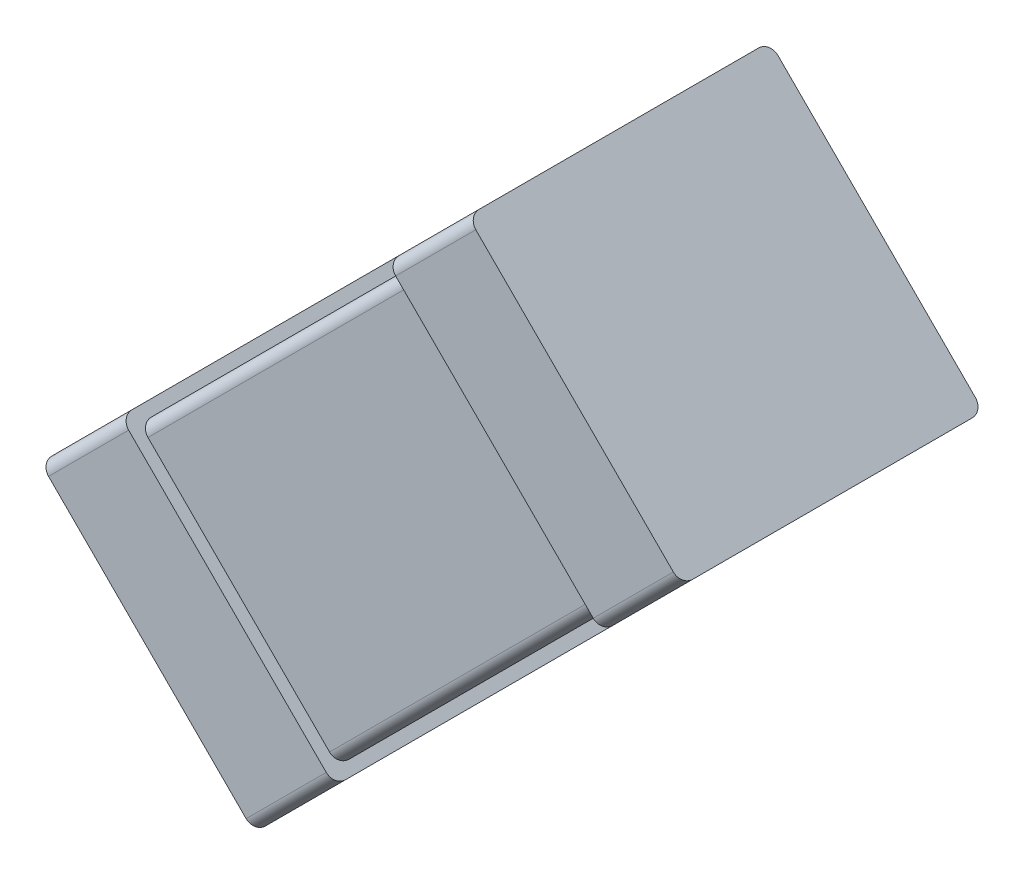
ISO-10303-21;
HEADER;
FILE_DESCRIPTION(('STEP AP214'),'2;1');
FILE_NAME('part.step','',(''),(''),'','','');
FILE_SCHEMA(('AUTOMOTIVE_DESIGN { 1 0 10303 214 1 1 1 1 }'));
ENDSEC;
DATA;
#1=APPLICATION_CONTEXT('core data for automotive mechanical design processes');
#2=APPLICATION_PROTOCOL_DEFINITION('international standard','automotive_design',2000,#1);
#3=PRODUCT_CONTEXT('',#1,'mechanical');
#4=PRODUCT('Part','Part','',(#3));
#5=PRODUCT_RELATED_PRODUCT_CATEGORY('part','',(#4));
#6=PRODUCT_DEFINITION_FORMATION('','',#4);
#7=PRODUCT_DEFINITION_CONTEXT('part definition',#1,'design');
#8=PRODUCT_DEFINITION('design','',#6,#7);
#9=PRODUCT_DEFINITION_SHAPE('','',#8);
#10=(LENGTH_UNIT() NAMED_UNIT(*) SI_UNIT(.MILLI.,.METRE.));
#11=(NAMED_UNIT(*) PLANE_ANGLE_UNIT() SI_UNIT($,.RADIAN.));
#12=(NAMED_UNIT(*) SI_UNIT($,.STERADIAN.) SOLID_ANGLE_UNIT());
#13=UNCERTAINTY_MEASURE_WITH_UNIT(LENGTH_MEASURE(1.E-05),#10,'distance_accuracy_value','');
#14=(GEOMETRIC_REPRESENTATION_CONTEXT(3) GLOBAL_UNCERTAINTY_ASSIGNED_CONTEXT((#13)) GLOBAL_UNIT_ASSIGNED_CONTEXT((#10,
#11,#12)) REPRESENTATION_CONTEXT('',''));
#15=CARTESIAN_POINT('',(0.,0.,0.));
#16=DIRECTION('',(0.,0.,1.));
#17=DIRECTION('',(1.,0.,0.));
#18=AXIS2_PLACEMENT_3D('',#15,#16,#17);
#19=CARTESIAN_POINT('',(157.545272417362,106.640886004825,112.211582908599));
#20=DIRECTION('',(0.707106781186547,0.707106781186548,0.));
#21=DIRECTION('',(0.,0.,-1.));
#22=AXIS2_PLACEMENT_3D('',#19,#20,#21);
#23=PLANE('',#22);
#24=DIRECTION('',(0.,0.,1.));
#25=VECTOR('',#24,1.);
#26=CARTESIAN_POINT('',(157.545272417362,106.640886004825,112.211582908599));
#27=LINE('',#26,#25);
#28=CARTESIAN_POINT('',(157.545272417362,106.640886004825,112.241582908599));
#29=VERTEX_POINT('',#28);
#30=CARTESIAN_POINT('',(157.545272417362,106.640886004825,112.981582908599));
#31=VERTEX_POINT('',#30);
#32=EDGE_CURVE('E67',#29,#31,#27,.T.);
#33=ORIENTED_EDGE('',*,*,#32,.F.);
#34=CARTESIAN_POINT('',(157.524059213927,106.66209920826,112.241582908599));
#35=DIRECTION('',(0.707106781186547,0.707106781186548,0.));
#36=DIRECTION('',(0.,0.,1.));
#37=AXIS2_PLACEMENT_3D('',#34,#35,#36);
#38=CIRCLE('',#37,0.0300000000000023);
#39=CARTESIAN_POINT('',(157.524059213927,106.66209920826,112.211582908599));
#40=VERTEX_POINT('',#39);
#41=EDGE_CURVE('E11',#29,#40,#38,.T.);
#42=ORIENTED_EDGE('',*,*,#41,.T.);
#43=DIRECTION('',(-0.707106781186548,0.707106781186547,0.));
#44=VECTOR('',#43,1.);
#45=CARTESIAN_POINT('',(157.545272417362,106.640886004825,112.211582908599));
#46=LINE('',#45,#44);
#47=CARTESIAN_POINT('',(157.000800195848,107.185358226338,112.211582908599));
#48=VERTEX_POINT('',#47);
#49=EDGE_CURVE('E55',#40,#48,#46,.T.);
#50=ORIENTED_EDGE('',*,*,#49,.T.);
#51=CARTESIAN_POINT('',(157.000800195848,107.185358226338,112.241582908599));
#52=DIRECTION('',(-0.707106781186547,-0.707106781186548,0.));
#53=DIRECTION('',(0.,0.,1.));
#54=AXIS2_PLACEMENT_3D('',#51,#52,#53);
#55=CIRCLE('',#54,0.0300000000000023);
#56=CARTESIAN_POINT('',(156.979586992412,107.206571429774,112.241582908599));
#57=VERTEX_POINT('',#56);
#58=EDGE_CURVE('E309',#57,#48,#55,.T.);
#59=ORIENTED_EDGE('',*,*,#58,.F.);
#60=DIRECTION('',(0.,0.,1.));
#61=VECTOR('',#60,1.);
#62=CARTESIAN_POINT('',(156.979586992412,107.206571429774,112.211582908599));
#63=LINE('',#62,#61);
#64=CARTESIAN_POINT('',(156.979586992412,107.206571429774,112.981582908599));
#65=VERTEX_POINT('',#64);
#66=EDGE_CURVE('E323',#57,#65,#63,.T.);
#67=ORIENTED_EDGE('',*,*,#66,.T.);
#68=CARTESIAN_POINT('',(157.000800195848,107.185358226338,112.981582908599));
#69=DIRECTION('',(0.707106781186547,0.707106781186548,0.));
#70=DIRECTION('',(0.,0.,1.));
#71=AXIS2_PLACEMENT_3D('',#68,#69,#70);
#72=CIRCLE('',#71,0.0300000000000023);
#73=CARTESIAN_POINT('',(157.000800195848,107.185358226338,113.011582908599));
#74=VERTEX_POINT('',#73);
#75=EDGE_CURVE('E327',#65,#74,#72,.T.);
#76=ORIENTED_EDGE('',*,*,#75,.T.);
#77=DIRECTION('',(-0.707106781186548,0.707106781186547,0.));
#78=VECTOR('',#77,1.);
#79=CARTESIAN_POINT('',(157.545272417362,106.640886004825,113.011582908599));
#80=LINE('',#79,#78);
#81=CARTESIAN_POINT('',(157.524059213927,106.66209920826,113.011582908599));
#82=VERTEX_POINT('',#81);
#83=EDGE_CURVE('E363',#82,#74,#80,.T.);
#84=ORIENTED_EDGE('',*,*,#83,.F.);
#85=CARTESIAN_POINT('',(157.524059213927,106.66209920826,112.981582908599));
#86=DIRECTION('',(-0.707106781186547,-0.707106781186548,0.));
#87=DIRECTION('',(0.,0.,1.));
#88=AXIS2_PLACEMENT_3D('',#85,#86,#87);
#89=CIRCLE('',#88,0.0300000000000023);
#90=EDGE_CURVE('E343',#31,#82,#89,.T.);
#91=ORIENTED_EDGE('',*,*,#90,.F.);
#92=EDGE_LOOP('',(#33,#42,#50,#59,#67,#76,#84,#91));
#93=FACE_BOUND('',#92,.T.);
#94=ADVANCED_FACE('F44',(#93),#23,.T.);
#95=CARTESIAN_POINT('',(156.767454958057,106.994439395418,112.211582908599));
#96=DIRECTION('',(-0.707106781186548,0.707106781186547,0.));
#97=DIRECTION('',(0.,0.,1.));
#98=AXIS2_PLACEMENT_3D('',#95,#96,#97);
#99=PLANE('',#98);
#100=ORIENTED_EDGE('',*,*,#66,.F.);
#101=DIRECTION('',(0.707106781186547,0.707106781186548,0.));
#102=VECTOR('',#101,1.);
#103=CARTESIAN_POINT('',(156.767454958057,106.994439395418,112.241582908599));
#104=LINE('',#103,#102);
#105=CARTESIAN_POINT('',(156.767454958057,106.994439395418,112.241582908599));
#106=VERTEX_POINT('',#105);
#107=EDGE_CURVE('E305',#106,#57,#104,.T.);
#108=ORIENTED_EDGE('',*,*,#107,.F.);
#109=DIRECTION('',(0.,0.,1.));
#110=VECTOR('',#109,1.);
#111=CARTESIAN_POINT('',(156.767454958057,106.994439395418,112.211582908599));
#112=LINE('',#111,#110);
#113=CARTESIAN_POINT('',(156.767454958057,106.994439395418,112.981582908599));
#114=VERTEX_POINT('',#113);
#115=EDGE_CURVE('E351',#106,#114,#112,.T.);
#116=ORIENTED_EDGE('',*,*,#115,.T.);
#117=DIRECTION('',(0.707106781186547,0.707106781186548,0.));
#118=VECTOR('',#117,1.);
#119=CARTESIAN_POINT('',(156.767454958057,106.994439395418,112.981582908599));
#120=LINE('',#119,#118);
#121=EDGE_CURVE('E393',#114,#65,#120,.T.);
#122=ORIENTED_EDGE('',*,*,#121,.T.);
#123=EDGE_LOOP('',(#100,#108,#116,#122));
#124=FACE_BOUND('',#123,.T.);
#125=ADVANCED_FACE('F602',(#124),#99,.T.);
#126=CARTESIAN_POINT('',(156.788668161492,106.973226191982,112.981582908599));
#127=DIRECTION('',(0.707106781186548,0.707106781186548,0.));
#128=DIRECTION('',(-0.707106781186548,0.707106781186548,0.));
#129=AXIS2_PLACEMENT_3D('',#126,#127,#128);
#130=CYLINDRICAL_SURFACE('',#129,0.0299999999999963);
#131=CARTESIAN_POINT('',(156.788668161492,106.973226191982,112.981582908599));
#132=DIRECTION('',(0.707106781186547,0.707106781186548,0.));
#133=DIRECTION('',(0.,0.,1.));
#134=AXIS2_PLACEMENT_3D('',#131,#132,#133);
#135=CIRCLE('',#134,0.0300000000000023);
#136=CARTESIAN_POINT('',(156.788668161492,106.973226191982,113.011582908599));
#137=VERTEX_POINT('',#136);
#138=EDGE_CURVE('E319',#114,#137,#135,.T.);
#139=ORIENTED_EDGE('',*,*,#138,.T.);
#140=DIRECTION('',(0.707106781186547,0.707106781186548,0.));
#141=VECTOR('',#140,1.);
#142=CARTESIAN_POINT('',(156.788668161492,106.973226191982,113.011582908599));
#143=LINE('',#142,#141);
#144=EDGE_CURVE('E308',#137,#74,#143,.T.);
#145=ORIENTED_EDGE('',*,*,#144,.T.);
#146=ORIENTED_EDGE('',*,*,#75,.F.);
#147=ORIENTED_EDGE('',*,*,#121,.F.);
#148=EDGE_LOOP('',(#139,#145,#146,#147));
#149=FACE_BOUND('',#148,.T.);
#150=ADVANCED_FACE('F512',(#149),#130,.T.);
#151=CARTESIAN_POINT('',(156.788668161492,106.973226191982,112.241582908599));
#152=DIRECTION('',(0.707106781186548,0.707106781186548,0.));
#153=DIRECTION('',(-0.707106781186548,0.707106781186548,0.));
#154=AXIS2_PLACEMENT_3D('',#151,#152,#153);
#155=CYLINDRICAL_SURFACE('',#154,0.0299999999999963);
#156=ORIENTED_EDGE('',*,*,#107,.T.);
#157=ORIENTED_EDGE('',*,*,#58,.T.);
#158=DIRECTION('',(0.707106781186547,0.707106781186548,0.));
#159=VECTOR('',#158,1.);
#160=CARTESIAN_POINT('',(156.788668161492,106.973226191982,112.211582908599));
#161=LINE('',#160,#159);
#162=CARTESIAN_POINT('',(156.788668161492,106.973226191982,112.211582908599));
#163=VERTEX_POINT('',#162);
#164=EDGE_CURVE('E359',#163,#48,#161,.T.);
#165=ORIENTED_EDGE('',*,*,#164,.F.);
#166=CARTESIAN_POINT('',(156.788668161492,106.973226191982,112.241582908599));
#167=DIRECTION('',(-0.707106781186547,-0.707106781186548,0.));
#168=DIRECTION('',(0.,0.,1.));
#169=AXIS2_PLACEMENT_3D('',#166,#167,#168);
#170=CIRCLE('',#169,0.0300000000000023);
#171=EDGE_CURVE('E397',#106,#163,#170,.T.);
#172=ORIENTED_EDGE('',*,*,#171,.F.);
#173=EDGE_LOOP('',(#156,#157,#165,#172));
#174=FACE_BOUND('',#173,.T.);
#175=ADVANCED_FACE('F600',(#174),#155,.T.);
#176=CARTESIAN_POINT('',(157.333140383006,106.428753970469,113.011582908599));
#177=DIRECTION('',(0.,0.,1.));
#178=DIRECTION('',(1.,0.,0.));
#179=AXIS2_PLACEMENT_3D('',#176,#177,#178);
#180=PLANE('',#179);
#181=DIRECTION('',(-0.707106781186548,0.707106781186547,0.));
#182=VECTOR('',#181,1.);
#183=CARTESIAN_POINT('',(157.333140383006,106.428753970469,113.011582908599));
#184=LINE('',#183,#182);
#185=CARTESIAN_POINT('',(157.31192717957,106.449967173904,113.011582908599));
#186=VERTEX_POINT('',#185);
#187=EDGE_CURVE('E407',#186,#137,#184,.T.);
#188=ORIENTED_EDGE('',*,*,#187,.F.);
#189=DIRECTION('',(0.707106781186547,0.707106781186548,0.));
#190=VECTOR('',#189,1.);
#191=CARTESIAN_POINT('',(157.31192717957,106.449967173904,113.011582908599));
#192=LINE('',#191,#190);
#193=EDGE_CURVE('E322',#186,#82,#192,.T.);
#194=ORIENTED_EDGE('',*,*,#193,.T.);
#195=ORIENTED_EDGE('',*,*,#83,.T.);
#196=ORIENTED_EDGE('',*,*,#144,.F.);
#197=EDGE_LOOP('',(#188,#194,#195,#196));
#198=FACE_BOUND('',#197,.T.);
#199=ADVANCED_FACE('F46',(#198),#180,.T.);
#200=CARTESIAN_POINT('',(157.333140383006,106.428753970469,112.211582908599));
#201=DIRECTION('',(0.,0.,1.));
#202=DIRECTION('',(1.,0.,0.));
#203=AXIS2_PLACEMENT_3D('',#200,#201,#202);
#204=PLANE('',#203);
#205=ORIENTED_EDGE('',*,*,#164,.T.);
#206=ORIENTED_EDGE('',*,*,#49,.F.);
#207=DIRECTION('',(0.707106781186547,0.707106781186548,0.));
#208=VECTOR('',#207,1.);
#209=CARTESIAN_POINT('',(157.31192717957,106.449967173904,112.211582908599));
#210=LINE('',#209,#208);
#211=CARTESIAN_POINT('',(157.31192717957,106.449967173904,112.211582908599));
#212=VERTEX_POINT('',#211);
#213=EDGE_CURVE('E48',#212,#40,#210,.T.);
#214=ORIENTED_EDGE('',*,*,#213,.F.);
#215=DIRECTION('',(-0.707106781186548,0.707106781186547,0.));
#216=VECTOR('',#215,1.);
#217=CARTESIAN_POINT('',(157.333140383006,106.428753970469,112.211582908599));
#218=LINE('',#217,#216);
#219=EDGE_CURVE('E364',#212,#163,#218,.T.);
#220=ORIENTED_EDGE('',*,*,#219,.T.);
#221=EDGE_LOOP('',(#205,#206,#214,#220));
#222=FACE_BOUND('',#221,.T.);
#223=ADVANCED_FACE('F596',(#222),#204,.F.);
#224=CARTESIAN_POINT('',(157.31192717957,106.449967173904,112.981582908599));
#225=DIRECTION('',(0.707106781186548,0.707106781186548,0.));
#226=DIRECTION('',(0.707106781186548,-0.707106781186548,0.));
#227=AXIS2_PLACEMENT_3D('',#224,#225,#226);
#228=CYLINDRICAL_SURFACE('',#227,0.0299999999999963);
#229=DIRECTION('',(0.707106781186547,0.707106781186548,0.));
#230=VECTOR('',#229,1.);
#231=CARTESIAN_POINT('',(157.333140383006,106.428753970469,112.981582908599));
#232=LINE('',#231,#230);
#233=CARTESIAN_POINT('',(157.333140383006,106.428753970469,112.981582908599));
#234=VERTEX_POINT('',#233);
#235=EDGE_CURVE('E346',#234,#31,#232,.T.);
#236=ORIENTED_EDGE('',*,*,#235,.T.);
#237=ORIENTED_EDGE('',*,*,#90,.T.);
#238=ORIENTED_EDGE('',*,*,#193,.F.);
#239=CARTESIAN_POINT('',(157.31192717957,106.449967173904,112.981582908599));
#240=DIRECTION('',(-0.707106781186547,-0.707106781186548,0.));
#241=DIRECTION('',(0.,0.,1.));
#242=AXIS2_PLACEMENT_3D('',#239,#240,#241);
#243=CIRCLE('',#242,0.0300000000000023);
#244=EDGE_CURVE('E403',#234,#186,#243,.T.);
#245=ORIENTED_EDGE('',*,*,#244,.F.);
#246=EDGE_LOOP('',(#236,#237,#238,#245));
#247=FACE_BOUND('',#246,.T.);
#248=ADVANCED_FACE('F520',(#247),#228,.T.);
#249=CARTESIAN_POINT('',(157.31192717957,106.449967173904,112.241582908599));
#250=DIRECTION('',(0.707106781186548,0.707106781186548,0.));
#251=DIRECTION('',(0.707106781186548,-0.707106781186548,0.));
#252=AXIS2_PLACEMENT_3D('',#249,#250,#251);
#253=CYLINDRICAL_SURFACE('',#252,0.0299999999999963);
#254=CARTESIAN_POINT('',(157.31192717957,106.449967173904,112.241582908599));
#255=DIRECTION('',(0.707106781186547,0.707106781186548,0.));
#256=DIRECTION('',(0.,0.,1.));
#257=AXIS2_PLACEMENT_3D('',#254,#255,#256);
#258=CIRCLE('',#257,0.0300000000000023);
#259=CARTESIAN_POINT('',(157.333140383006,106.428753970469,112.241582908599));
#260=VERTEX_POINT('',#259);
#261=EDGE_CURVE('E347',#260,#212,#258,.T.);
#262=ORIENTED_EDGE('',*,*,#261,.T.);
#263=ORIENTED_EDGE('',*,*,#213,.T.);
#264=ORIENTED_EDGE('',*,*,#41,.F.);
#265=DIRECTION('',(0.707106781186547,0.707106781186548,0.));
#266=VECTOR('',#265,1.);
#267=CARTESIAN_POINT('',(157.333140383006,106.428753970469,112.241582908599));
#268=LINE('',#267,#266);
#269=EDGE_CURVE('E451',#260,#29,#268,.T.);
#270=ORIENTED_EDGE('',*,*,#269,.F.);
#271=EDGE_LOOP('',(#262,#263,#264,#270));
#272=FACE_BOUND('',#271,.T.);
#273=ADVANCED_FACE('F592',(#272),#253,.T.);
#274=CARTESIAN_POINT('',(157.333140383006,106.428753970469,112.211582908599));
#275=DIRECTION('',(-0.707106781186548,0.707106781186547,0.));
#276=DIRECTION('',(0.,0.,1.));
#277=AXIS2_PLACEMENT_3D('',#274,#275,#276);
#278=PLANE('',#277);
#279=ORIENTED_EDGE('',*,*,#235,.F.);
#280=DIRECTION('',(0.,0.,1.));
#281=VECTOR('',#280,1.);
#282=CARTESIAN_POINT('',(157.333140383006,106.428753970469,112.211582908599));
#283=LINE('',#282,#281);
#284=EDGE_CURVE('E314',#260,#234,#283,.T.);
#285=ORIENTED_EDGE('',*,*,#284,.F.);
#286=ORIENTED_EDGE('',*,*,#269,.T.);
#287=ORIENTED_EDGE('',*,*,#32,.T.);
#288=EDGE_LOOP('',(#279,#285,#286,#287));
#289=FACE_BOUND('',#288,.T.);
#290=ADVANCED_FACE('F664',(#289),#278,.F.);
#291=CARTESIAN_POINT('',(157.333140383006,106.428753970469,112.211582908599));
#292=DIRECTION('',(0.707106781186547,0.707106781186548,0.));
#293=DIRECTION('',(0.,0.,-1.));
#294=AXIS2_PLACEMENT_3D('',#291,#292,#293);
#295=PLANE('',#294);
#296=ORIENTED_EDGE('',*,*,#244,.T.);
#297=ORIENTED_EDGE('',*,*,#187,.T.);
#298=ORIENTED_EDGE('',*,*,#138,.F.);
#299=ORIENTED_EDGE('',*,*,#115,.F.);
#300=ORIENTED_EDGE('',*,*,#171,.T.);
#301=ORIENTED_EDGE('',*,*,#219,.F.);
#302=ORIENTED_EDGE('',*,*,#261,.F.);
#303=ORIENTED_EDGE('',*,*,#284,.T.);
#304=EDGE_LOOP('',(#296,#297,#298,#299,#300,#301,#302,#303));
#305=FACE_BOUND('',#304,.T.);
#306=DIRECTION('',(-0.707106781186548,0.707106781186547,0.));
#307=VECTOR('',#306,1.);
#308=CARTESIAN_POINT('',(157.31192717957,106.449967173904,112.241582908599));
#309=LINE('',#308,#307);
#310=CARTESIAN_POINT('',(157.290713976134,106.47118037734,112.241582908599));
#311=VERTEX_POINT('',#310);
#312=CARTESIAN_POINT('',(156.809881364928,106.952012988547,112.241582908599));
#313=VERTEX_POINT('',#312);
#314=EDGE_CURVE('E310',#311,#313,#309,.T.);
#315=ORIENTED_EDGE('',*,*,#314,.T.);
#316=CARTESIAN_POINT('',(156.809881364928,106.952012988547,112.271582908599));
#317=DIRECTION('',(-0.707106781186547,-0.707106781186548,0.));
#318=DIRECTION('',(0.,0.,1.));
#319=AXIS2_PLACEMENT_3D('',#316,#317,#318);
#320=CIRCLE('',#319,0.0300000000000023);
#321=CARTESIAN_POINT('',(156.788668161492,106.973226191982,112.271582908599));
#322=VERTEX_POINT('',#321);
#323=EDGE_CURVE('E341',#322,#313,#320,.T.);
#324=ORIENTED_EDGE('',*,*,#323,.F.);
#325=DIRECTION('',(0.,0.,1.));
#326=VECTOR('',#325,1.);
#327=CARTESIAN_POINT('',(156.788668161492,106.973226191982,112.241582908599));
#328=LINE('',#327,#326);
#329=CARTESIAN_POINT('',(156.788668161492,106.973226191982,112.951582908599));
#330=VERTEX_POINT('',#329);
#331=EDGE_CURVE('E315',#322,#330,#328,.T.);
#332=ORIENTED_EDGE('',*,*,#331,.T.);
#333=CARTESIAN_POINT('',(156.809881364928,106.952012988547,112.951582908599));
#334=DIRECTION('',(0.707106781186547,0.707106781186548,0.));
#335=DIRECTION('',(0.,0.,1.));
#336=AXIS2_PLACEMENT_3D('',#333,#334,#335);
#337=CIRCLE('',#336,0.0300000000000023);
#338=CARTESIAN_POINT('',(156.809881364928,106.952012988547,112.981582908599));
#339=VERTEX_POINT('',#338);
#340=EDGE_CURVE('E458',#330,#339,#337,.T.);
#341=ORIENTED_EDGE('',*,*,#340,.T.);
#342=DIRECTION('',(-0.707106781186548,0.707106781186547,0.));
#343=VECTOR('',#342,1.);
#344=CARTESIAN_POINT('',(157.31192717957,106.449967173904,112.981582908599));
#345=LINE('',#344,#343);
#346=CARTESIAN_POINT('',(157.290713976134,106.47118037734,112.981582908599));
#347=VERTEX_POINT('',#346);
#348=EDGE_CURVE('E333',#347,#339,#345,.T.);
#349=ORIENTED_EDGE('',*,*,#348,.F.);
#350=CARTESIAN_POINT('',(157.290713976134,106.47118037734,112.951582908599));
#351=DIRECTION('',(-0.707106781186547,-0.707106781186548,0.));
#352=DIRECTION('',(0.,0.,1.));
#353=AXIS2_PLACEMENT_3D('',#350,#351,#352);
#354=CIRCLE('',#353,0.0300000000000023);
#355=CARTESIAN_POINT('',(157.31192717957,106.449967173904,112.951582908599));
#356=VERTEX_POINT('',#355);
#357=EDGE_CURVE('E332',#356,#347,#354,.T.);
#358=ORIENTED_EDGE('',*,*,#357,.F.);
#359=DIRECTION('',(0.,0.,1.));
#360=VECTOR('',#359,1.);
#361=CARTESIAN_POINT('',(157.31192717957,106.449967173904,112.241582908599));
#362=LINE('',#361,#360);
#363=CARTESIAN_POINT('',(157.31192717957,106.449967173904,112.271582908599));
#364=VERTEX_POINT('',#363);
#365=EDGE_CURVE('E467',#364,#356,#362,.T.);
#366=ORIENTED_EDGE('',*,*,#365,.F.);
#367=CARTESIAN_POINT('',(157.290713976134,106.47118037734,112.271582908599));
#368=DIRECTION('',(0.707106781186547,0.707106781186548,0.));
#369=DIRECTION('',(0.,0.,1.));
#370=AXIS2_PLACEMENT_3D('',#367,#368,#369);
#371=CIRCLE('',#370,0.0300000000000023);
#372=EDGE_CURVE('E466',#364,#311,#371,.T.);
#373=ORIENTED_EDGE('',*,*,#372,.T.);
#374=EDGE_LOOP('',(#315,#324,#332,#341,#349,#358,#366,#373));
#375=FACE_BOUND('',#374,.T.);
#376=ADVANCED_FACE('F516',(#305,#375),#295,.F.);
#377=CARTESIAN_POINT('',(156.604820398384,105.742860392718,112.241582908599));
#378=DIRECTION('',(-0.707106781186548,0.707106781186547,0.));
#379=DIRECTION('',(0.,0.,1.));
#380=AXIS2_PLACEMENT_3D('',#377,#378,#379);
#381=PLANE('',#380);
#382=DIRECTION('',(0.707106781186547,0.707106781186548,0.));
#383=VECTOR('',#382,1.);
#384=CARTESIAN_POINT('',(156.604820398384,105.742860392718,112.951582908599));
#385=LINE('',#384,#383);
#386=CARTESIAN_POINT('',(156.604820398384,105.742860392718,112.951582908599));
#387=VERTEX_POINT('',#386);
#388=EDGE_CURVE('E303',#387,#356,#385,.T.);
#389=ORIENTED_EDGE('',*,*,#388,.F.);
#390=DIRECTION('',(0.,0.,1.));
#391=VECTOR('',#390,1.);
#392=CARTESIAN_POINT('',(156.604820398384,105.742860392718,112.241582908599));
#393=LINE('',#392,#391);
#394=CARTESIAN_POINT('',(156.604820398384,105.742860392718,112.271582908599));
#395=VERTEX_POINT('',#394);
#396=EDGE_CURVE('E401',#395,#387,#393,.T.);
#397=ORIENTED_EDGE('',*,*,#396,.F.);
#398=DIRECTION('',(0.707106781186547,0.707106781186548,0.));
#399=VECTOR('',#398,1.);
#400=CARTESIAN_POINT('',(156.604820398384,105.742860392718,112.271582908599));
#401=LINE('',#400,#399);
#402=EDGE_CURVE('E462',#395,#364,#401,.T.);
#403=ORIENTED_EDGE('',*,*,#402,.T.);
#404=ORIENTED_EDGE('',*,*,#365,.T.);
#405=EDGE_LOOP('',(#389,#397,#403,#404));
#406=FACE_BOUND('',#405,.T.);
#407=ADVANCED_FACE('F571',(#406),#381,.F.);
#408=CARTESIAN_POINT('',(156.583607194948,105.764073596153,112.951582908599));
#409=DIRECTION('',(0.707106781186548,0.707106781186548,0.));
#410=DIRECTION('',(0.707106781186548,-0.707106781186548,0.));
#411=AXIS2_PLACEMENT_3D('',#408,#409,#410);
#412=CYLINDRICAL_SURFACE('',#411,0.0299999999999963);
#413=ORIENTED_EDGE('',*,*,#388,.T.);
#414=ORIENTED_EDGE('',*,*,#357,.T.);
#415=DIRECTION('',(0.707106781186547,0.707106781186548,0.));
#416=VECTOR('',#415,1.);
#417=CARTESIAN_POINT('',(156.583607194948,105.764073596153,112.981582908599));
#418=LINE('',#417,#416);
#419=CARTESIAN_POINT('',(156.583607194948,105.764073596153,112.981582908599));
#420=VERTEX_POINT('',#419);
#421=EDGE_CURVE('E328',#420,#347,#418,.T.);
#422=ORIENTED_EDGE('',*,*,#421,.F.);
#423=CARTESIAN_POINT('',(156.583607194948,105.764073596153,112.951582908599));
#424=DIRECTION('',(-0.707106781186547,-0.707106781186548,0.));
#425=DIRECTION('',(0.,0.,1.));
#426=AXIS2_PLACEMENT_3D('',#423,#424,#425);
#427=CIRCLE('',#426,0.0300000000000023);
#428=EDGE_CURVE('E398',#387,#420,#427,.T.);
#429=ORIENTED_EDGE('',*,*,#428,.F.);
#430=EDGE_LOOP('',(#413,#414,#422,#429));
#431=FACE_BOUND('',#430,.T.);
#432=ADVANCED_FACE('F568',(#431),#412,.T.);
#433=CARTESIAN_POINT('',(156.604820398384,105.742860392718,112.981582908599));
#434=DIRECTION('',(0.,0.,1.));
#435=DIRECTION('',(1.,0.,0.));
#436=AXIS2_PLACEMENT_3D('',#433,#434,#435);
#437=PLANE('',#436);
#438=DIRECTION('',(-0.707106781186548,0.707106781186547,0.));
#439=VECTOR('',#438,1.);
#440=CARTESIAN_POINT('',(156.604820398384,105.742860392718,112.981582908599));
#441=LINE('',#440,#439);
#442=CARTESIAN_POINT('',(156.102774583742,106.24490620736,112.981582908599));
#443=VERTEX_POINT('',#442);
#444=EDGE_CURVE('E402',#420,#443,#441,.T.);
#445=ORIENTED_EDGE('',*,*,#444,.F.);
#446=ORIENTED_EDGE('',*,*,#421,.T.);
#447=ORIENTED_EDGE('',*,*,#348,.T.);
#448=DIRECTION('',(0.707106781186547,0.707106781186548,0.));
#449=VECTOR('',#448,1.);
#450=CARTESIAN_POINT('',(156.102774583742,106.24490620736,112.981582908599));
#451=LINE('',#450,#449);
#452=EDGE_CURVE('E442',#443,#339,#451,.T.);
#453=ORIENTED_EDGE('',*,*,#452,.F.);
#454=EDGE_LOOP('',(#445,#446,#447,#453));
#455=FACE_BOUND('',#454,.T.);
#456=ADVANCED_FACE('F556',(#455),#437,.T.);
#457=CARTESIAN_POINT('',(156.102774583742,106.24490620736,112.951582908599));
#458=DIRECTION('',(0.707106781186548,0.707106781186548,0.));
#459=DIRECTION('',(-0.707106781186548,0.707106781186548,0.));
#460=AXIS2_PLACEMENT_3D('',#457,#458,#459);
#461=CYLINDRICAL_SURFACE('',#460,0.0299999999999963);
#462=CARTESIAN_POINT('',(156.102774583742,106.24490620736,112.951582908599));
#463=DIRECTION('',(0.707106781186547,0.707106781186548,0.));
#464=DIRECTION('',(0.,0.,1.));
#465=AXIS2_PLACEMENT_3D('',#462,#463,#464);
#466=CIRCLE('',#465,0.0300000000000023);
#467=CARTESIAN_POINT('',(156.081561380306,106.266119410796,112.951582908599));
#468=VERTEX_POINT('',#467);
#469=EDGE_CURVE('E497',#468,#443,#466,.T.);
#470=ORIENTED_EDGE('',*,*,#469,.T.);
#471=ORIENTED_EDGE('',*,*,#452,.T.);
#472=ORIENTED_EDGE('',*,*,#340,.F.);
#473=DIRECTION('',(0.707106781186547,0.707106781186548,0.));
#474=VECTOR('',#473,1.);
#475=CARTESIAN_POINT('',(156.081561380306,106.266119410796,112.951582908599));
#476=LINE('',#475,#474);
#477=EDGE_CURVE('E381',#468,#330,#476,.T.);
#478=ORIENTED_EDGE('',*,*,#477,.F.);
#479=EDGE_LOOP('',(#470,#471,#472,#478));
#480=FACE_BOUND('',#479,.T.);
#481=ADVANCED_FACE('F552',(#480),#461,.T.);
#482=CARTESIAN_POINT('',(156.081561380306,106.266119410796,112.241582908599));
#483=DIRECTION('',(-0.707106781186548,0.707106781186547,0.));
#484=DIRECTION('',(0.,0.,1.));
#485=AXIS2_PLACEMENT_3D('',#482,#483,#484);
#486=PLANE('',#485);
#487=ORIENTED_EDGE('',*,*,#331,.F.);
#488=DIRECTION('',(0.707106781186547,0.707106781186548,0.));
#489=VECTOR('',#488,1.);
#490=CARTESIAN_POINT('',(156.081561380306,106.266119410796,112.271582908599));
#491=LINE('',#490,#489);
#492=CARTESIAN_POINT('',(156.081561380306,106.266119410796,112.271582908599));
#493=VERTEX_POINT('',#492);
#494=EDGE_CURVE('E377',#493,#322,#491,.T.);
#495=ORIENTED_EDGE('',*,*,#494,.F.);
#496=DIRECTION('',(0.,0.,1.));
#497=VECTOR('',#496,1.);
#498=CARTESIAN_POINT('',(156.081561380306,106.266119410796,112.241582908599));
#499=LINE('',#498,#497);
#500=EDGE_CURVE('E438',#493,#468,#499,.T.);
#501=ORIENTED_EDGE('',*,*,#500,.T.);
#502=ORIENTED_EDGE('',*,*,#477,.T.);
#503=EDGE_LOOP('',(#487,#495,#501,#502));
#504=FACE_BOUND('',#503,.T.);
#505=ADVANCED_FACE('F560',(#504),#486,.T.);
#506=CARTESIAN_POINT('',(156.102774583742,106.24490620736,112.271582908599));
#507=DIRECTION('',(0.707106781186548,0.707106781186548,0.));
#508=DIRECTION('',(-0.707106781186548,0.707106781186548,0.));
#509=AXIS2_PLACEMENT_3D('',#506,#507,#508);
#510=CYLINDRICAL_SURFACE('',#509,0.0299999999999963);
#511=ORIENTED_EDGE('',*,*,#494,.T.);
#512=ORIENTED_EDGE('',*,*,#323,.T.);
#513=DIRECTION('',(0.707106781186547,0.707106781186548,0.));
#514=VECTOR('',#513,1.);
#515=CARTESIAN_POINT('',(156.102774583742,106.24490620736,112.241582908599));
#516=LINE('',#515,#514);
#517=CARTESIAN_POINT('',(156.102774583742,106.24490620736,112.241582908599));
#518=VERTEX_POINT('',#517);
#519=EDGE_CURVE('E337',#518,#313,#516,.T.);
#520=ORIENTED_EDGE('',*,*,#519,.F.);
#521=CARTESIAN_POINT('',(156.102774583742,106.24490620736,112.271582908599));
#522=DIRECTION('',(-0.707106781186547,-0.707106781186548,0.));
#523=DIRECTION('',(0.,0.,1.));
#524=AXIS2_PLACEMENT_3D('',#521,#522,#523);
#525=CIRCLE('',#524,0.0300000000000023);
#526=EDGE_CURVE('E411',#493,#518,#525,.T.);
#527=ORIENTED_EDGE('',*,*,#526,.F.);
#528=EDGE_LOOP('',(#511,#512,#520,#527));
#529=FACE_BOUND('',#528,.T.);
#530=ADVANCED_FACE('F624',(#529),#510,.T.);
#531=CARTESIAN_POINT('',(156.604820398384,105.742860392718,112.241582908599));
#532=DIRECTION('',(0.,0.,1.));
#533=DIRECTION('',(1.,0.,0.));
#534=AXIS2_PLACEMENT_3D('',#531,#532,#533);
#535=PLANE('',#534);
#536=ORIENTED_EDGE('',*,*,#519,.T.);
#537=ORIENTED_EDGE('',*,*,#314,.F.);
#538=DIRECTION('',(0.707106781186547,0.707106781186548,0.));
#539=VECTOR('',#538,1.);
#540=CARTESIAN_POINT('',(156.583607194948,105.764073596153,112.241582908599));
#541=LINE('',#540,#539);
#542=CARTESIAN_POINT('',(156.583607194948,105.764073596153,112.241582908599));
#543=VERTEX_POINT('',#542);
#544=EDGE_CURVE('E470',#543,#311,#541,.T.);
#545=ORIENTED_EDGE('',*,*,#544,.F.);
#546=DIRECTION('',(-0.707106781186548,0.707106781186547,0.));
#547=VECTOR('',#546,1.);
#548=CARTESIAN_POINT('',(156.604820398384,105.742860392718,112.241582908599));
#549=LINE('',#548,#547);
#550=EDGE_CURVE('E342',#543,#518,#549,.T.);
#551=ORIENTED_EDGE('',*,*,#550,.T.);
#552=EDGE_LOOP('',(#536,#537,#545,#551));
#553=FACE_BOUND('',#552,.T.);
#554=ADVANCED_FACE('F637',(#553),#535,.F.);
#555=CARTESIAN_POINT('',(156.583607194948,105.764073596153,112.271582908599));
#556=DIRECTION('',(0.707106781186548,0.707106781186548,0.));
#557=DIRECTION('',(0.707106781186548,-0.707106781186548,0.));
#558=AXIS2_PLACEMENT_3D('',#555,#556,#557);
#559=CYLINDRICAL_SURFACE('',#558,0.0299999999999963);
#560=CARTESIAN_POINT('',(156.583607194948,105.764073596153,112.271582908599));
#561=DIRECTION('',(0.707106781186547,0.707106781186548,0.));
#562=DIRECTION('',(0.,0.,1.));
#563=AXIS2_PLACEMENT_3D('',#560,#561,#562);
#564=CIRCLE('',#563,0.0300000000000023);
#565=EDGE_CURVE('E389',#395,#543,#564,.T.);
#566=ORIENTED_EDGE('',*,*,#565,.T.);
#567=ORIENTED_EDGE('',*,*,#544,.T.);
#568=ORIENTED_EDGE('',*,*,#372,.F.);
#569=ORIENTED_EDGE('',*,*,#402,.F.);
#570=EDGE_LOOP('',(#566,#567,#568,#569));
#571=FACE_BOUND('',#570,.T.);
#572=ADVANCED_FACE('F575',(#571),#559,.T.);
#573=CARTESIAN_POINT('',(156.626033601819,105.721647189282,112.211582908599));
#574=DIRECTION('',(0.707106781186547,0.707106781186548,0.));
#575=DIRECTION('',(0.,0.,-1.));
#576=AXIS2_PLACEMENT_3D('',#573,#574,#575);
#577=PLANE('',#576);
#578=DIRECTION('',(0.,0.,1.));
#579=VECTOR('',#578,1.);
#580=CARTESIAN_POINT('',(156.626033601819,105.721647189282,112.211582908599));
#581=LINE('',#580,#579);
#582=CARTESIAN_POINT('',(156.626033601819,105.721647189282,112.241582908599));
#583=VERTEX_POINT('',#582);
#584=CARTESIAN_POINT('',(156.626033601819,105.721647189282,112.981582908599));
#585=VERTEX_POINT('',#584);
#586=EDGE_CURVE('E376',#583,#585,#581,.T.);
#587=ORIENTED_EDGE('',*,*,#586,.F.);
#588=CARTESIAN_POINT('',(156.604820398384,105.742860392718,112.241582908599));
#589=DIRECTION('',(0.707106781186547,0.707106781186548,0.));
#590=DIRECTION('',(0.,0.,1.));
#591=AXIS2_PLACEMENT_3D('',#588,#589,#590);
#592=CIRCLE('',#591,0.0300000000000023);
#593=CARTESIAN_POINT('',(156.604820398384,105.742860392718,112.211582908599));
#594=VERTEX_POINT('',#593);
#595=EDGE_CURVE('E461',#583,#594,#592,.T.);
#596=ORIENTED_EDGE('',*,*,#595,.T.);
#597=DIRECTION('',(-0.707106781186548,0.707106781186547,0.));
#598=VECTOR('',#597,1.);
#599=CARTESIAN_POINT('',(156.626033601819,105.721647189282,112.211582908599));
#600=LINE('',#599,#598);
#601=CARTESIAN_POINT('',(156.081561380306,106.266119410796,112.211582908599));
#602=VERTEX_POINT('',#601);
#603=EDGE_CURVE('E277',#594,#602,#600,.T.);
#604=ORIENTED_EDGE('',*,*,#603,.T.);
#605=CARTESIAN_POINT('',(156.081561380306,106.266119410796,112.241582908599));
#606=DIRECTION('',(-0.707106781186547,-0.707106781186548,0.));
#607=DIRECTION('',(0.,0.,1.));
#608=AXIS2_PLACEMENT_3D('',#605,#606,#607);
#609=CIRCLE('',#608,0.0300000000000023);
#610=CARTESIAN_POINT('',(156.06034817687,106.287332614231,112.241582908599));
#611=VERTEX_POINT('',#610);
#612=EDGE_CURVE('E270',#611,#602,#609,.T.);
#613=ORIENTED_EDGE('',*,*,#612,.F.);
#614=DIRECTION('',(0.,0.,1.));
#615=VECTOR('',#614,1.);
#616=CARTESIAN_POINT('',(156.06034817687,106.287332614231,112.211582908599));
#617=LINE('',#616,#615);
#618=CARTESIAN_POINT('',(156.06034817687,106.287332614231,112.981582908599));
#619=VERTEX_POINT('',#618);
#620=EDGE_CURVE('E274',#611,#619,#617,.T.);
#621=ORIENTED_EDGE('',*,*,#620,.T.);
#622=CARTESIAN_POINT('',(156.081561380306,106.266119410796,112.981582908599));
#623=DIRECTION('',(0.707106781186547,0.707106781186548,0.));
#624=DIRECTION('',(0.,0.,1.));
#625=AXIS2_PLACEMENT_3D('',#622,#623,#624);
#626=CIRCLE('',#625,0.0300000000000023);
#627=CARTESIAN_POINT('',(156.081561380306,106.266119410796,113.011582908599));
#628=VERTEX_POINT('',#627);
#629=EDGE_CURVE('E262',#619,#628,#626,.T.);
#630=ORIENTED_EDGE('',*,*,#629,.T.);
#631=DIRECTION('',(-0.707106781186548,0.707106781186547,0.));
#632=VECTOR('',#631,1.);
#633=CARTESIAN_POINT('',(156.626033601819,105.721647189282,113.011582908599));
#634=LINE('',#633,#632);
#635=CARTESIAN_POINT('',(156.604820398384,105.742860392718,113.011582908599));
#636=VERTEX_POINT('',#635);
#637=EDGE_CURVE('E355',#636,#628,#634,.T.);
#638=ORIENTED_EDGE('',*,*,#637,.F.);
#639=CARTESIAN_POINT('',(156.604820398384,105.742860392718,112.981582908599));
#640=DIRECTION('',(-0.707106781186547,-0.707106781186548,0.));
#641=DIRECTION('',(0.,0.,1.));
#642=AXIS2_PLACEMENT_3D('',#639,#640,#641);
#643=CIRCLE('',#642,0.0300000000000023);
#644=EDGE_CURVE('E437',#585,#636,#643,.T.);
#645=ORIENTED_EDGE('',*,*,#644,.F.);
#646=EDGE_LOOP('',(#587,#596,#604,#613,#621,#630,#638,#645));
#647=FACE_BOUND('',#646,.T.);
#648=ORIENTED_EDGE('',*,*,#565,.F.);
#649=ORIENTED_EDGE('',*,*,#396,.T.);
#650=ORIENTED_EDGE('',*,*,#428,.T.);
#651=ORIENTED_EDGE('',*,*,#444,.T.);
#652=ORIENTED_EDGE('',*,*,#469,.F.);
#653=ORIENTED_EDGE('',*,*,#500,.F.);
#654=ORIENTED_EDGE('',*,*,#526,.T.);
#655=ORIENTED_EDGE('',*,*,#550,.F.);
#656=EDGE_LOOP('',(#648,#649,#650,#651,#652,#653,#654,#655));
#657=FACE_BOUND('',#656,.T.);
#658=ADVANCED_FACE('F272',(#647,#657),#577,.T.);
#659=CARTESIAN_POINT('',(155.848216142514,106.075200579876,112.211582908599));
#660=DIRECTION('',(-0.707106781186548,0.707106781186547,0.));
#661=DIRECTION('',(0.,0.,1.));
#662=AXIS2_PLACEMENT_3D('',#659,#660,#661);
#663=PLANE('',#662);
#664=ORIENTED_EDGE('',*,*,#620,.F.);
#665=DIRECTION('',(0.707106781186547,0.707106781186548,0.));
#666=VECTOR('',#665,1.);
#667=CARTESIAN_POINT('',(155.848216142514,106.075200579876,112.241582908599));
#668=LINE('',#667,#666);
#669=CARTESIAN_POINT('',(155.848216142514,106.075200579876,112.241582908599));
#670=VERTEX_POINT('',#669);
#671=EDGE_CURVE('E282',#670,#611,#668,.T.);
#672=ORIENTED_EDGE('',*,*,#671,.F.);
#673=DIRECTION('',(0.,0.,1.));
#674=VECTOR('',#673,1.);
#675=CARTESIAN_POINT('',(155.848216142514,106.075200579876,112.211582908599));
#676=LINE('',#675,#674);
#677=CARTESIAN_POINT('',(155.848216142514,106.075200579876,112.981582908599));
#678=VERTEX_POINT('',#677);
#679=EDGE_CURVE('E336',#670,#678,#676,.T.);
#680=ORIENTED_EDGE('',*,*,#679,.T.);
#681=DIRECTION('',(0.707106781186547,0.707106781186548,0.));
#682=VECTOR('',#681,1.);
#683=CARTESIAN_POINT('',(155.848216142514,106.075200579876,112.981582908599));
#684=LINE('',#683,#682);
#685=EDGE_CURVE('E288',#678,#619,#684,.T.);
#686=ORIENTED_EDGE('',*,*,#685,.T.);
#687=EDGE_LOOP('',(#664,#672,#680,#686));
#688=FACE_BOUND('',#687,.T.);
#689=ADVANCED_FACE('F286',(#688),#663,.T.);
#690=CARTESIAN_POINT('',(155.86942934595,106.05398737644,112.981582908599));
#691=DIRECTION('',(0.707106781186548,0.707106781186548,0.));
#692=DIRECTION('',(-0.707106781186548,0.707106781186548,0.));
#693=AXIS2_PLACEMENT_3D('',#690,#691,#692);
#694=CYLINDRICAL_SURFACE('',#693,0.0299999999999963);
#695=CARTESIAN_POINT('',(155.86942934595,106.05398737644,112.981582908599));
#696=DIRECTION('',(0.707106781186547,0.707106781186548,0.));
#697=DIRECTION('',(0.,0.,1.));
#698=AXIS2_PLACEMENT_3D('',#695,#696,#697);
#699=CIRCLE('',#698,0.0300000000000023);
#700=CARTESIAN_POINT('',(155.86942934595,106.05398737644,113.011582908599));
#701=VERTEX_POINT('',#700);
#702=EDGE_CURVE('E299',#678,#701,#699,.T.);
#703=ORIENTED_EDGE('',*,*,#702,.T.);
#704=DIRECTION('',(0.707106781186547,0.707106781186548,0.));
#705=VECTOR('',#704,1.);
#706=CARTESIAN_POINT('',(155.86942934595,106.05398737644,113.011582908599));
#707=LINE('',#706,#705);
#708=EDGE_CURVE('E293',#701,#628,#707,.T.);
#709=ORIENTED_EDGE('',*,*,#708,.T.);
#710=ORIENTED_EDGE('',*,*,#629,.F.);
#711=ORIENTED_EDGE('',*,*,#685,.F.);
#712=EDGE_LOOP('',(#703,#709,#710,#711));
#713=FACE_BOUND('',#712,.T.);
#714=ADVANCED_FACE('F532',(#713),#694,.T.);
#715=CARTESIAN_POINT('',(155.86942934595,106.05398737644,112.241582908599));
#716=DIRECTION('',(0.707106781186548,0.707106781186548,0.));
#717=DIRECTION('',(-0.707106781186548,0.707106781186548,0.));
#718=AXIS2_PLACEMENT_3D('',#715,#716,#717);
#719=CYLINDRICAL_SURFACE('',#718,0.0299999999999963);
#720=ORIENTED_EDGE('',*,*,#671,.T.);
#721=ORIENTED_EDGE('',*,*,#612,.T.);
#722=DIRECTION('',(0.707106781186547,0.707106781186548,0.));
#723=VECTOR('',#722,1.);
#724=CARTESIAN_POINT('',(155.86942934595,106.05398737644,112.211582908599));
#725=LINE('',#724,#723);
#726=CARTESIAN_POINT('',(155.86942934595,106.05398737644,112.211582908599));
#727=VERTEX_POINT('',#726);
#728=EDGE_CURVE('E358',#727,#602,#725,.T.);
#729=ORIENTED_EDGE('',*,*,#728,.F.);
#730=CARTESIAN_POINT('',(155.86942934595,106.05398737644,112.241582908599));
#731=DIRECTION('',(-0.707106781186547,-0.707106781186548,0.));
#732=DIRECTION('',(0.,0.,1.));
#733=AXIS2_PLACEMENT_3D('',#730,#731,#732);
#734=CIRCLE('',#733,0.0300000000000023);
#735=EDGE_CURVE('E218',#670,#727,#734,.T.);
#736=ORIENTED_EDGE('',*,*,#735,.F.);
#737=EDGE_LOOP('',(#720,#721,#729,#736));
#738=FACE_BOUND('',#737,.T.);
#739=ADVANCED_FACE('F291',(#738),#719,.T.);
#740=CARTESIAN_POINT('',(156.413901567464,105.509515154926,113.011582908599));
#741=DIRECTION('',(0.,0.,1.));
#742=DIRECTION('',(1.,0.,0.));
#743=AXIS2_PLACEMENT_3D('',#740,#741,#742);
#744=PLANE('',#743);
#745=DIRECTION('',(-0.707106781186548,0.707106781186547,0.));
#746=VECTOR('',#745,1.);
#747=CARTESIAN_POINT('',(156.413901567464,105.509515154926,113.011582908599));
#748=LINE('',#747,#746);
#749=CARTESIAN_POINT('',(156.392688364028,105.530728358362,113.011582908599));
#750=VERTEX_POINT('',#749);
#751=EDGE_CURVE('E229',#750,#701,#748,.T.);
#752=ORIENTED_EDGE('',*,*,#751,.F.);
#753=DIRECTION('',(0.707106781186547,0.707106781186548,0.));
#754=VECTOR('',#753,1.);
#755=CARTESIAN_POINT('',(156.392688364028,105.530728358362,113.011582908599));
#756=LINE('',#755,#754);
#757=EDGE_CURVE('E283',#750,#636,#756,.T.);
#758=ORIENTED_EDGE('',*,*,#757,.T.);
#759=ORIENTED_EDGE('',*,*,#637,.T.);
#760=ORIENTED_EDGE('',*,*,#708,.F.);
#761=EDGE_LOOP('',(#752,#758,#759,#760));
#762=FACE_BOUND('',#761,.T.);
#763=ADVANCED_FACE('F632',(#762),#744,.T.);
#764=CARTESIAN_POINT('',(156.413901567464,105.509515154926,112.211582908599));
#765=DIRECTION('',(0.,0.,1.));
#766=DIRECTION('',(1.,0.,0.));
#767=AXIS2_PLACEMENT_3D('',#764,#765,#766);
#768=PLANE('',#767);
#769=ORIENTED_EDGE('',*,*,#728,.T.);
#770=ORIENTED_EDGE('',*,*,#603,.F.);
#771=DIRECTION('',(0.707106781186547,0.707106781186548,0.));
#772=VECTOR('',#771,1.);
#773=CARTESIAN_POINT('',(156.392688364028,105.530728358362,112.211582908599));
#774=LINE('',#773,#772);
#775=CARTESIAN_POINT('',(156.392688364028,105.530728358362,112.211582908599));
#776=VERTEX_POINT('',#775);
#777=EDGE_CURVE('E375',#776,#594,#774,.T.);
#778=ORIENTED_EDGE('',*,*,#777,.F.);
#779=DIRECTION('',(-0.707106781186548,0.707106781186547,0.));
#780=VECTOR('',#779,1.);
#781=CARTESIAN_POINT('',(156.413901567464,105.509515154926,112.211582908599));
#782=LINE('',#781,#780);
#783=EDGE_CURVE('E436',#776,#727,#782,.T.);
#784=ORIENTED_EDGE('',*,*,#783,.T.);
#785=EDGE_LOOP('',(#769,#770,#778,#784));
#786=FACE_BOUND('',#785,.T.);
#787=ADVANCED_FACE('F647',(#786),#768,.F.);
#788=CARTESIAN_POINT('',(156.392688364028,105.530728358362,112.981582908599));
#789=DIRECTION('',(0.707106781186548,0.707106781186548,0.));
#790=DIRECTION('',(0.707106781186548,-0.707106781186548,0.));
#791=AXIS2_PLACEMENT_3D('',#788,#789,#790);
#792=CYLINDRICAL_SURFACE('',#791,0.0299999999999963);
#793=DIRECTION('',(0.707106781186547,0.707106781186548,0.));
#794=VECTOR('',#793,1.);
#795=CARTESIAN_POINT('',(156.413901567464,105.509515154926,112.981582908599));
#796=LINE('',#795,#794);
#797=CARTESIAN_POINT('',(156.413901567464,105.509515154926,112.981582908599));
#798=VERTEX_POINT('',#797);
#799=EDGE_CURVE('E432',#798,#585,#796,.T.);
#800=ORIENTED_EDGE('',*,*,#799,.T.);
#801=ORIENTED_EDGE('',*,*,#644,.T.);
#802=ORIENTED_EDGE('',*,*,#757,.F.);
#803=CARTESIAN_POINT('',(156.392688364028,105.530728358362,112.981582908599));
#804=DIRECTION('',(-0.707106781186547,-0.707106781186548,0.));
#805=DIRECTION('',(0.,0.,1.));
#806=AXIS2_PLACEMENT_3D('',#803,#804,#805);
#807=CIRCLE('',#806,0.0300000000000023);
#808=EDGE_CURVE('E370',#798,#750,#807,.T.);
#809=ORIENTED_EDGE('',*,*,#808,.F.);
#810=EDGE_LOOP('',(#800,#801,#802,#809));
#811=FACE_BOUND('',#810,.T.);
#812=ADVANCED_FACE('F620',(#811),#792,.T.);
#813=CARTESIAN_POINT('',(156.392688364028,105.530728358362,112.241582908599));
#814=DIRECTION('',(0.707106781186548,0.707106781186548,0.));
#815=DIRECTION('',(0.707106781186548,-0.707106781186548,0.));
#816=AXIS2_PLACEMENT_3D('',#813,#814,#815);
#817=CYLINDRICAL_SURFACE('',#816,0.0299999999999963);
#818=CARTESIAN_POINT('',(156.392688364028,105.530728358362,112.241582908599));
#819=DIRECTION('',(0.707106781186547,0.707106781186548,0.));
#820=DIRECTION('',(0.,0.,1.));
#821=AXIS2_PLACEMENT_3D('',#818,#819,#820);
#822=CIRCLE('',#821,0.0300000000000023);
#823=CARTESIAN_POINT('',(156.413901567464,105.509515154926,112.241582908599));
#824=VERTEX_POINT('',#823);
#825=EDGE_CURVE('E385',#824,#776,#822,.T.);
#826=ORIENTED_EDGE('',*,*,#825,.T.);
#827=ORIENTED_EDGE('',*,*,#777,.T.);
#828=ORIENTED_EDGE('',*,*,#595,.F.);
#829=DIRECTION('',(0.707106781186547,0.707106781186548,0.));
#830=VECTOR('',#829,1.);
#831=CARTESIAN_POINT('',(156.413901567464,105.509515154926,112.241582908599));
#832=LINE('',#831,#830);
#833=EDGE_CURVE('E371',#824,#583,#832,.T.);
#834=ORIENTED_EDGE('',*,*,#833,.F.);
#835=EDGE_LOOP('',(#826,#827,#828,#834));
#836=FACE_BOUND('',#835,.T.);
#837=ADVANCED_FACE('F617',(#836),#817,.T.);
#838=CARTESIAN_POINT('',(156.413901567464,105.509515154926,112.211582908599));
#839=DIRECTION('',(-0.707106781186548,0.707106781186547,0.));
#840=DIRECTION('',(0.,0.,1.));
#841=AXIS2_PLACEMENT_3D('',#838,#839,#840);
#842=PLANE('',#841);
#843=ORIENTED_EDGE('',*,*,#799,.F.);
#844=DIRECTION('',(0.,0.,1.));
#845=VECTOR('',#844,1.);
#846=CARTESIAN_POINT('',(156.413901567464,105.509515154926,112.211582908599));
#847=LINE('',#846,#845);
#848=EDGE_CURVE('E353',#824,#798,#847,.T.);
#849=ORIENTED_EDGE('',*,*,#848,.F.);
#850=ORIENTED_EDGE('',*,*,#833,.T.);
#851=ORIENTED_EDGE('',*,*,#586,.T.);
#852=EDGE_LOOP('',(#843,#849,#850,#851));
#853=FACE_BOUND('',#852,.T.);
#854=ADVANCED_FACE('F613',(#853),#842,.F.);
#855=CARTESIAN_POINT('',(156.413901567464,105.509515154926,112.211582908599));
#856=DIRECTION('',(0.707106781186547,0.707106781186548,0.));
#857=DIRECTION('',(0.,0.,-1.));
#858=AXIS2_PLACEMENT_3D('',#855,#856,#857);
#859=PLANE('',#858);
#860=ORIENTED_EDGE('',*,*,#808,.T.);
#861=ORIENTED_EDGE('',*,*,#751,.T.);
#862=ORIENTED_EDGE('',*,*,#702,.F.);
#863=ORIENTED_EDGE('',*,*,#679,.F.);
#864=ORIENTED_EDGE('',*,*,#735,.T.);
#865=ORIENTED_EDGE('',*,*,#783,.F.);
#866=ORIENTED_EDGE('',*,*,#825,.F.);
#867=ORIENTED_EDGE('',*,*,#848,.T.);
#868=EDGE_LOOP('',(#860,#861,#862,#863,#864,#865,#866,#867));
#869=FACE_BOUND('',#868,.T.);
#870=ADVANCED_FACE('F534',(#869),#859,.F.);
#871=CLOSED_SHELL('',(#94,#125,#150,#175,#199,#223,#248,#273,#290,#376,#407,#432,#456,#481,#505,
#530,#554,#572,#658,#689,#714,#739,#763,#787,#812,#837,#854,#870));
#872=MANIFOLD_SOLID_BREP('B2',#871);
#873=ADVANCED_BREP_SHAPE_REPRESENTATION('',(#18,#872),#14);
#874=SHAPE_DEFINITION_REPRESENTATION(#9,#873);
ENDSEC;
END-ISO-10303-21;
